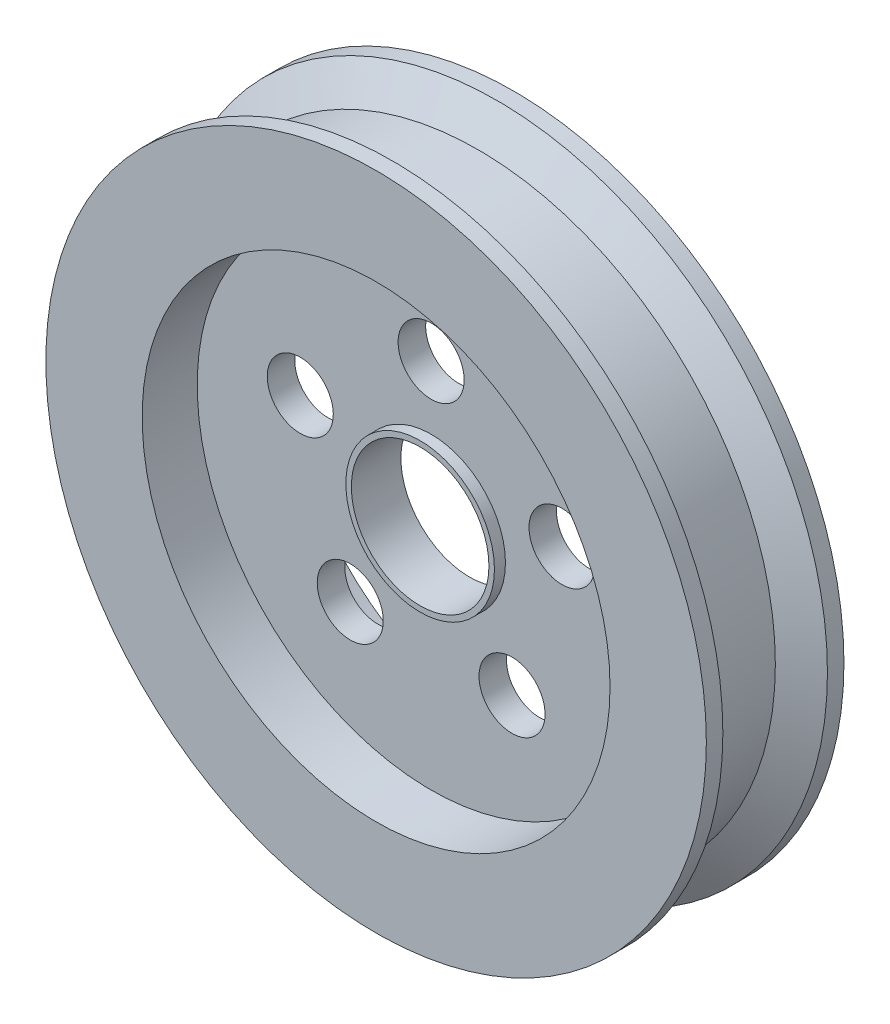
ISO-10303-21;
HEADER;
FILE_DESCRIPTION(('STEP AP214'),'2;1');
FILE_NAME('part.step','',(''),(''),'','','');
FILE_SCHEMA(('AUTOMOTIVE_DESIGN { 1 0 10303 214 1 1 1 1 }'));
ENDSEC;
DATA;
#1=APPLICATION_CONTEXT('core data for automotive mechanical design processes');
#2=APPLICATION_PROTOCOL_DEFINITION('international standard','automotive_design',2000,#1);
#3=PRODUCT_CONTEXT('',#1,'mechanical');
#4=PRODUCT('Part','Part','',(#3));
#5=PRODUCT_RELATED_PRODUCT_CATEGORY('part','',(#4));
#6=PRODUCT_DEFINITION_FORMATION('','',#4);
#7=PRODUCT_DEFINITION_CONTEXT('part definition',#1,'design');
#8=PRODUCT_DEFINITION('design','',#6,#7);
#9=PRODUCT_DEFINITION_SHAPE('','',#8);
#10=(LENGTH_UNIT() NAMED_UNIT(*) SI_UNIT(.MILLI.,.METRE.));
#11=(NAMED_UNIT(*) PLANE_ANGLE_UNIT() SI_UNIT($,.RADIAN.));
#12=(NAMED_UNIT(*) SI_UNIT($,.STERADIAN.) SOLID_ANGLE_UNIT());
#13=UNCERTAINTY_MEASURE_WITH_UNIT(LENGTH_MEASURE(1.E-05),#10,'distance_accuracy_value','');
#14=(GEOMETRIC_REPRESENTATION_CONTEXT(3) GLOBAL_UNCERTAINTY_ASSIGNED_CONTEXT((#13)) GLOBAL_UNIT_ASSIGNED_CONTEXT((#10,
#11,#12)) REPRESENTATION_CONTEXT('',''));
#15=CARTESIAN_POINT('',(0.,0.,0.));
#16=DIRECTION('',(0.,0.,1.));
#17=DIRECTION('',(1.,0.,0.));
#18=AXIS2_PLACEMENT_3D('',#15,#16,#17);
#19=CARTESIAN_POINT('',(0.,0.,12.5));
#20=DIRECTION('',(0.,0.,-1.));
#21=DIRECTION('',(-1.,0.,0.));
#22=AXIS2_PLACEMENT_3D('',#19,#20,#21);
#23=CYLINDRICAL_SURFACE('',#22,60.);
#24=CARTESIAN_POINT('',(0.,0.,-9.5));
#25=DIRECTION('',(0.,0.,1.));
#26=DIRECTION('',(1.,0.,0.));
#27=AXIS2_PLACEMENT_3D('',#24,#25,#26);
#28=CIRCLE('',#27,60.);
#29=CARTESIAN_POINT('',(60.,0.,-9.5));
#30=VERTEX_POINT('',#29);
#31=EDGE_CURVE('E59',#30,#30,#28,.T.);
#32=ORIENTED_EDGE('',*,*,#31,.F.);
#33=EDGE_LOOP('',(#32));
#34=FACE_BOUND('',#33,.T.);
#35=CARTESIAN_POINT('',(0.,0.,-12.5));
#36=DIRECTION('',(0.,0.,1.));
#37=DIRECTION('',(1.,0.,0.));
#38=AXIS2_PLACEMENT_3D('',#35,#36,#37);
#39=CIRCLE('',#38,60.);
#40=CARTESIAN_POINT('',(60.,0.,-12.5));
#41=VERTEX_POINT('',#40);
#42=EDGE_CURVE('E91',#41,#41,#39,.T.);
#43=ORIENTED_EDGE('',*,*,#42,.T.);
#44=EDGE_LOOP('',(#43));
#45=FACE_BOUND('',#44,.T.);
#46=ADVANCED_FACE('F33',(#34,#45),#23,.T.);
#47=CARTESIAN_POINT('',(0.,0.,12.5));
#48=DIRECTION('',(0.,0.,1.));
#49=DIRECTION('',(1.,0.,0.));
#50=AXIS2_PLACEMENT_3D('',#47,#48,#49);
#51=PLANE('',#50);
#52=CARTESIAN_POINT('',(0.,0.,12.5));
#53=DIRECTION('',(0.,0.,1.));
#54=DIRECTION('',(1.,0.,0.));
#55=AXIS2_PLACEMENT_3D('',#52,#53,#54);
#56=CIRCLE('',#55,42.5);
#57=CARTESIAN_POINT('',(42.5,0.,12.5));
#58=VERTEX_POINT('',#57);
#59=EDGE_CURVE('E84',#58,#58,#56,.T.);
#60=ORIENTED_EDGE('',*,*,#59,.F.);
#61=EDGE_LOOP('',(#60));
#62=FACE_BOUND('',#61,.T.);
#63=CARTESIAN_POINT('',(0.,0.,12.5));
#64=DIRECTION('',(0.,0.,1.));
#65=DIRECTION('',(1.,0.,0.));
#66=AXIS2_PLACEMENT_3D('',#63,#64,#65);
#67=CIRCLE('',#66,60.);
#68=CARTESIAN_POINT('',(60.,0.,12.5));
#69=VERTEX_POINT('',#68);
#70=EDGE_CURVE('E45',#69,#69,#67,.T.);
#71=ORIENTED_EDGE('',*,*,#70,.T.);
#72=EDGE_LOOP('',(#71));
#73=FACE_BOUND('',#72,.T.);
#74=ADVANCED_FACE('F138',(#62,#73),#51,.T.);
#75=CARTESIAN_POINT('',(0.,0.,-12.5));
#76=DIRECTION('',(0.,0.,1.));
#77=DIRECTION('',(1.,0.,0.));
#78=AXIS2_PLACEMENT_3D('',#75,#76,#77);
#79=PLANE('',#78);
#80=CARTESIAN_POINT('',(0.,0.,-12.5));
#81=DIRECTION('',(0.,0.,1.));
#82=DIRECTION('',(1.,0.,0.));
#83=AXIS2_PLACEMENT_3D('',#80,#81,#82);
#84=CIRCLE('',#83,42.5);
#85=CARTESIAN_POINT('',(42.5,0.,-12.5));
#86=VERTEX_POINT('',#85);
#87=EDGE_CURVE('E85',#86,#86,#84,.T.);
#88=ORIENTED_EDGE('',*,*,#87,.T.);
#89=EDGE_LOOP('',(#88));
#90=FACE_BOUND('',#89,.T.);
#91=ORIENTED_EDGE('',*,*,#42,.F.);
#92=EDGE_LOOP('',(#91));
#93=FACE_BOUND('',#92,.T.);
#94=ADVANCED_FACE('F135',(#90,#93),#79,.F.);
#95=CARTESIAN_POINT('',(0.,0.,9.5));
#96=DIRECTION('',(0.,0.,1.));
#97=DIRECTION('',(1.,0.,0.));
#98=AXIS2_PLACEMENT_3D('',#95,#96,#97);
#99=CIRCLE('',#98,60.);
#100=CARTESIAN_POINT('',(60.,0.,9.5));
#101=VERTEX_POINT('',#100);
#102=EDGE_CURVE('E56',#101,#101,#99,.T.);
#103=ORIENTED_EDGE('',*,*,#102,.T.);
#104=EDGE_LOOP('',(#103));
#105=FACE_BOUND('',#104,.T.);
#106=ORIENTED_EDGE('',*,*,#70,.F.);
#107=EDGE_LOOP('',(#106));
#108=FACE_BOUND('',#107,.T.);
#109=ADVANCED_FACE('F35',(#105,#108),#23,.T.);
#110=CARTESIAN_POINT('',(0.,0.,2.5));
#111=DIRECTION('',(0.,0.,1.));
#112=DIRECTION('',(1.,0.,0.));
#113=AXIS2_PLACEMENT_3D('',#110,#111,#112);
#114=CYLINDRICAL_SURFACE('',#113,42.5);
#115=CARTESIAN_POINT('',(0.,0.,2.5));
#116=DIRECTION('',(0.,0.,1.));
#117=DIRECTION('',(1.,0.,0.));
#118=AXIS2_PLACEMENT_3D('',#115,#116,#117);
#119=CIRCLE('',#118,42.5);
#120=CARTESIAN_POINT('',(42.5,0.,2.5));
#121=VERTEX_POINT('',#120);
#122=EDGE_CURVE('E88',#121,#121,#119,.T.);
#123=ORIENTED_EDGE('',*,*,#122,.F.);
#124=EDGE_LOOP('',(#123));
#125=FACE_BOUND('',#124,.T.);
#126=ORIENTED_EDGE('',*,*,#59,.T.);
#127=EDGE_LOOP('',(#126));
#128=FACE_BOUND('',#127,.T.);
#129=ADVANCED_FACE('F150',(#125,#128),#114,.F.);
#130=CARTESIAN_POINT('',(0.,0.,2.5));
#131=DIRECTION('',(0.,0.,1.));
#132=DIRECTION('',(1.,0.,0.));
#133=AXIS2_PLACEMENT_3D('',#130,#131,#132);
#134=PLANE('',#133);
#135=CARTESIAN_POINT('',(0.,0.,2.5));
#136=DIRECTION('',(0.,0.,1.));
#137=DIRECTION('',(1.,0.,0.));
#138=AXIS2_PLACEMENT_3D('',#135,#136,#137);
#139=CIRCLE('',#138,13.5);
#140=CARTESIAN_POINT('',(13.5,0.,2.5));
#141=VERTEX_POINT('',#140);
#142=EDGE_CURVE('E10',#141,#141,#139,.T.);
#143=ORIENTED_EDGE('',*,*,#142,.F.);
#144=EDGE_LOOP('',(#143));
#145=FACE_BOUND('',#144,.T.);
#146=CARTESIAN_POINT('',(14.6946313073117,-20.2254248593738,2.5));
#147=DIRECTION('',(0.,0.,1.));
#148=DIRECTION('',(-0.809016994374951,-0.587785252292469,0.));
#149=AXIS2_PLACEMENT_3D('',#146,#147,#148);
#150=CIRCLE('',#149,6.);
#151=CARTESIAN_POINT('',(9.84052934106201,-23.7521363731286,2.5));
#152=VERTEX_POINT('',#151);
#153=EDGE_CURVE('E63',#152,#152,#150,.T.);
#154=ORIENTED_EDGE('',*,*,#153,.F.);
#155=EDGE_LOOP('',(#154));
#156=FACE_BOUND('',#155,.T.);
#157=CARTESIAN_POINT('',(-14.694631307312,-20.2254248593736,2.5));
#158=DIRECTION('',(0.,0.,1.));
#159=DIRECTION('',(-0.809016994374942,0.58778525229248,0.));
#160=AXIS2_PLACEMENT_3D('',#157,#158,#159);
#161=CIRCLE('',#160,6.);
#162=CARTESIAN_POINT('',(-19.5487332735617,-16.6987133456187,2.5));
#163=VERTEX_POINT('',#162);
#164=EDGE_CURVE('E67',#163,#163,#161,.T.);
#165=ORIENTED_EDGE('',*,*,#164,.F.);
#166=EDGE_LOOP('',(#165));
#167=FACE_BOUND('',#166,.T.);
#168=CARTESIAN_POINT('',(-23.7764129073788,7.72542485937396,2.5));
#169=DIRECTION('',(0.,0.,1.));
#170=DIRECTION('',(0.309016994374958,0.95105651629515,0.));
#171=AXIS2_PLACEMENT_3D('',#168,#169,#170);
#172=CIRCLE('',#171,6.);
#173=CARTESIAN_POINT('',(-21.922310941129,13.4317639571449,2.5));
#174=VERTEX_POINT('',#173);
#175=EDGE_CURVE('E62',#174,#174,#172,.T.);
#176=ORIENTED_EDGE('',*,*,#175,.F.);
#177=EDGE_LOOP('',(#176));
#178=FACE_BOUND('',#177,.T.);
#179=CARTESIAN_POINT('',(23.7764129073789,7.72542485937362,2.5));
#180=DIRECTION('',(0.,0.,1.));
#181=DIRECTION('',(0.309016994374945,-0.951056516295155,0.));
#182=AXIS2_PLACEMENT_3D('',#179,#180,#181);
#183=CIRCLE('',#182,6.);
#184=CARTESIAN_POINT('',(25.6305148736285,2.01908576160269,2.5));
#185=VERTEX_POINT('',#184);
#186=EDGE_CURVE('E72',#185,#185,#183,.T.);
#187=ORIENTED_EDGE('',*,*,#186,.F.);
#188=EDGE_LOOP('',(#187));
#189=FACE_BOUND('',#188,.T.);
#190=CARTESIAN_POINT('',(0.,25.,2.5));
#191=DIRECTION('',(0.,0.,1.));
#192=DIRECTION('',(1.,0.,0.));
#193=AXIS2_PLACEMENT_3D('',#190,#191,#192);
#194=CIRCLE('',#193,6.);
#195=CARTESIAN_POINT('',(6.,25.,2.5));
#196=VERTEX_POINT('',#195);
#197=EDGE_CURVE('E77',#196,#196,#194,.T.);
#198=ORIENTED_EDGE('',*,*,#197,.F.);
#199=EDGE_LOOP('',(#198));
#200=FACE_BOUND('',#199,.T.);
#201=ORIENTED_EDGE('',*,*,#122,.T.);
#202=EDGE_LOOP('',(#201));
#203=FACE_BOUND('',#202,.T.);
#204=ADVANCED_FACE('F131',(#145,#156,#167,#178,#189,#200,#203),#134,.T.);
#205=CARTESIAN_POINT('',(0.,0.,-2.5));
#206=DIRECTION('',(0.,0.,-1.));
#207=DIRECTION('',(-1.,0.,0.));
#208=AXIS2_PLACEMENT_3D('',#205,#206,#207);
#209=CYLINDRICAL_SURFACE('',#208,42.5);
#210=CARTESIAN_POINT('',(0.,0.,-2.5));
#211=DIRECTION('',(0.,0.,1.));
#212=DIRECTION('',(1.,0.,0.));
#213=AXIS2_PLACEMENT_3D('',#210,#211,#212);
#214=CIRCLE('',#213,42.5);
#215=CARTESIAN_POINT('',(42.5,0.,-2.5));
#216=VERTEX_POINT('',#215);
#217=EDGE_CURVE('E81',#216,#216,#214,.T.);
#218=ORIENTED_EDGE('',*,*,#217,.T.);
#219=EDGE_LOOP('',(#218));
#220=FACE_BOUND('',#219,.T.);
#221=ORIENTED_EDGE('',*,*,#87,.F.);
#222=EDGE_LOOP('',(#221));
#223=FACE_BOUND('',#222,.T.);
#224=ADVANCED_FACE('F116',(#220,#223),#209,.F.);
#225=CARTESIAN_POINT('',(0.,0.,-2.5));
#226=DIRECTION('',(0.,0.,-1.));
#227=DIRECTION('',(1.,0.,0.));
#228=AXIS2_PLACEMENT_3D('',#225,#226,#227);
#229=PLANE('',#228);
#230=CARTESIAN_POINT('',(0.,0.,-2.5));
#231=DIRECTION('',(0.,0.,-1.));
#232=DIRECTION('',(-1.,0.,0.));
#233=AXIS2_PLACEMENT_3D('',#230,#231,#232);
#234=CIRCLE('',#233,13.5);
#235=CARTESIAN_POINT('',(-13.5,0.,-2.5));
#236=VERTEX_POINT('',#235);
#237=EDGE_CURVE('E37',#236,#236,#234,.T.);
#238=ORIENTED_EDGE('',*,*,#237,.F.);
#239=EDGE_LOOP('',(#238));
#240=FACE_BOUND('',#239,.T.);
#241=CARTESIAN_POINT('',(14.6946313073117,-20.2254248593738,-2.5));
#242=DIRECTION('',(0.,0.,-1.));
#243=DIRECTION('',(-1.,0.,0.));
#244=AXIS2_PLACEMENT_3D('',#241,#242,#243);
#245=CIRCLE('',#244,6.);
#246=CARTESIAN_POINT('',(8.69463130731171,-20.2254248593738,-2.5));
#247=VERTEX_POINT('',#246);
#248=EDGE_CURVE('E76',#247,#247,#245,.T.);
#249=ORIENTED_EDGE('',*,*,#248,.F.);
#250=EDGE_LOOP('',(#249));
#251=FACE_BOUND('',#250,.T.);
#252=CARTESIAN_POINT('',(-14.694631307312,-20.2254248593736,-2.5));
#253=DIRECTION('',(0.,0.,-1.));
#254=DIRECTION('',(-1.,0.,0.));
#255=AXIS2_PLACEMENT_3D('',#252,#253,#254);
#256=CIRCLE('',#255,6.);
#257=CARTESIAN_POINT('',(-20.694631307312,-20.2254248593736,-2.5));
#258=VERTEX_POINT('',#257);
#259=EDGE_CURVE('E104',#258,#258,#256,.T.);
#260=ORIENTED_EDGE('',*,*,#259,.F.);
#261=EDGE_LOOP('',(#260));
#262=FACE_BOUND('',#261,.T.);
#263=CARTESIAN_POINT('',(-23.7764129073788,7.72542485937396,-2.5));
#264=DIRECTION('',(0.,0.,-1.));
#265=DIRECTION('',(-1.,0.,0.));
#266=AXIS2_PLACEMENT_3D('',#263,#264,#265);
#267=CIRCLE('',#266,6.);
#268=CARTESIAN_POINT('',(-29.7764129073788,7.72542485937396,-2.5));
#269=VERTEX_POINT('',#268);
#270=EDGE_CURVE('E66',#269,#269,#267,.T.);
#271=ORIENTED_EDGE('',*,*,#270,.F.);
#272=EDGE_LOOP('',(#271));
#273=FACE_BOUND('',#272,.T.);
#274=CARTESIAN_POINT('',(23.7764129073789,7.72542485937362,-2.5));
#275=DIRECTION('',(0.,0.,-1.));
#276=DIRECTION('',(-1.,0.,0.));
#277=AXIS2_PLACEMENT_3D('',#274,#275,#276);
#278=CIRCLE('',#277,6.);
#279=CARTESIAN_POINT('',(17.7764129073789,7.72542485937362,-2.5));
#280=VERTEX_POINT('',#279);
#281=EDGE_CURVE('E75',#280,#280,#278,.T.);
#282=ORIENTED_EDGE('',*,*,#281,.F.);
#283=EDGE_LOOP('',(#282));
#284=FACE_BOUND('',#283,.T.);
#285=CARTESIAN_POINT('',(0.,25.,-2.5));
#286=DIRECTION('',(0.,0.,-1.));
#287=DIRECTION('',(-1.,0.,0.));
#288=AXIS2_PLACEMENT_3D('',#285,#286,#287);
#289=CIRCLE('',#288,6.);
#290=CARTESIAN_POINT('',(-6.,25.,-2.5));
#291=VERTEX_POINT('',#290);
#292=EDGE_CURVE('E80',#291,#291,#289,.T.);
#293=ORIENTED_EDGE('',*,*,#292,.F.);
#294=EDGE_LOOP('',(#293));
#295=FACE_BOUND('',#294,.T.);
#296=ORIENTED_EDGE('',*,*,#217,.F.);
#297=EDGE_LOOP('',(#296));
#298=FACE_BOUND('',#297,.T.);
#299=ADVANCED_FACE('F112',(#240,#251,#262,#273,#284,#295,#298),#229,.T.);
#300=CARTESIAN_POINT('',(0.,25.,-7.5));
#301=DIRECTION('',(0.,0.,1.));
#302=DIRECTION('',(1.,0.,0.));
#303=AXIS2_PLACEMENT_3D('',#300,#301,#302);
#304=CYLINDRICAL_SURFACE('',#303,6.);
#305=ORIENTED_EDGE('',*,*,#292,.T.);
#306=EDGE_LOOP('',(#305));
#307=FACE_BOUND('',#306,.T.);
#308=ORIENTED_EDGE('',*,*,#197,.T.);
#309=EDGE_LOOP('',(#308));
#310=FACE_BOUND('',#309,.T.);
#311=ADVANCED_FACE('F115',(#307,#310),#304,.F.);
#312=CARTESIAN_POINT('',(23.7764129073789,7.72542485937362,-7.5));
#313=DIRECTION('',(0.,0.,1.));
#314=DIRECTION('',(1.,0.,0.));
#315=AXIS2_PLACEMENT_3D('',#312,#313,#314);
#316=CYLINDRICAL_SURFACE('',#315,6.);
#317=ORIENTED_EDGE('',*,*,#281,.T.);
#318=EDGE_LOOP('',(#317));
#319=FACE_BOUND('',#318,.T.);
#320=ORIENTED_EDGE('',*,*,#186,.T.);
#321=EDGE_LOOP('',(#320));
#322=FACE_BOUND('',#321,.T.);
#323=ADVANCED_FACE('F191',(#319,#322),#316,.F.);
#324=CARTESIAN_POINT('',(-23.7764129073788,7.72542485937396,-7.5));
#325=DIRECTION('',(0.,0.,1.));
#326=DIRECTION('',(1.,0.,0.));
#327=AXIS2_PLACEMENT_3D('',#324,#325,#326);
#328=CYLINDRICAL_SURFACE('',#327,6.);
#329=ORIENTED_EDGE('',*,*,#270,.T.);
#330=EDGE_LOOP('',(#329));
#331=FACE_BOUND('',#330,.T.);
#332=ORIENTED_EDGE('',*,*,#175,.T.);
#333=EDGE_LOOP('',(#332));
#334=FACE_BOUND('',#333,.T.);
#335=ADVANCED_FACE('F187',(#331,#334),#328,.F.);
#336=CARTESIAN_POINT('',(-14.694631307312,-20.2254248593736,-7.5));
#337=DIRECTION('',(0.,0.,1.));
#338=DIRECTION('',(1.,0.,0.));
#339=AXIS2_PLACEMENT_3D('',#336,#337,#338);
#340=CYLINDRICAL_SURFACE('',#339,6.);
#341=ORIENTED_EDGE('',*,*,#259,.T.);
#342=EDGE_LOOP('',(#341));
#343=FACE_BOUND('',#342,.T.);
#344=ORIENTED_EDGE('',*,*,#164,.T.);
#345=EDGE_LOOP('',(#344));
#346=FACE_BOUND('',#345,.T.);
#347=ADVANCED_FACE('F182',(#343,#346),#340,.F.);
#348=CARTESIAN_POINT('',(14.6946313073117,-20.2254248593738,-7.5));
#349=DIRECTION('',(0.,0.,1.));
#350=DIRECTION('',(1.,0.,0.));
#351=AXIS2_PLACEMENT_3D('',#348,#349,#350);
#352=CYLINDRICAL_SURFACE('',#351,6.);
#353=ORIENTED_EDGE('',*,*,#248,.T.);
#354=EDGE_LOOP('',(#353));
#355=FACE_BOUND('',#354,.T.);
#356=ORIENTED_EDGE('',*,*,#153,.T.);
#357=EDGE_LOOP('',(#356));
#358=FACE_BOUND('',#357,.T.);
#359=ADVANCED_FACE('F109',(#355,#358),#352,.F.);
#360=CARTESIAN_POINT('',(0.,0.,-9.5));
#361=DIRECTION('',(0.,0.,-1.));
#362=DIRECTION('',(-1.,0.,0.));
#363=AXIS2_PLACEMENT_3D('',#360,#361,#362);
#364=CONICAL_SURFACE('',#363,60.,1.04719755119659);
#365=CARTESIAN_POINT('',(0.,0.,-6.03589838486221));
#366=DIRECTION('',(0.,0.,1.));
#367=DIRECTION('',(1.,0.,0.));
#368=AXIS2_PLACEMENT_3D('',#365,#366,#367);
#369=CIRCLE('',#368,54.);
#370=CARTESIAN_POINT('',(54.,0.,-6.03589838486221));
#371=VERTEX_POINT('',#370);
#372=EDGE_CURVE('E50',#371,#371,#369,.T.);
#373=ORIENTED_EDGE('',*,*,#372,.F.);
#374=EDGE_LOOP('',(#373));
#375=FACE_BOUND('',#374,.T.);
#376=ORIENTED_EDGE('',*,*,#31,.T.);
#377=EDGE_LOOP('',(#376));
#378=FACE_BOUND('',#377,.T.);
#379=ADVANCED_FACE('F166',(#375,#378),#364,.T.);
#380=CARTESIAN_POINT('',(0.,0.,6.03589838486221));
#381=DIRECTION('',(0.,0.,1.));
#382=DIRECTION('',(1.,0.,0.));
#383=AXIS2_PLACEMENT_3D('',#380,#381,#382);
#384=CONICAL_SURFACE('',#383,54.,1.04719755119659);
#385=ORIENTED_EDGE('',*,*,#102,.F.);
#386=EDGE_LOOP('',(#385));
#387=FACE_BOUND('',#386,.T.);
#388=CARTESIAN_POINT('',(0.,0.,6.03589838486221));
#389=DIRECTION('',(0.,0.,1.));
#390=DIRECTION('',(1.,0.,0.));
#391=AXIS2_PLACEMENT_3D('',#388,#389,#390);
#392=CIRCLE('',#391,54.);
#393=CARTESIAN_POINT('',(54.,0.,6.03589838486221));
#394=VERTEX_POINT('',#393);
#395=EDGE_CURVE('E53',#394,#394,#392,.T.);
#396=ORIENTED_EDGE('',*,*,#395,.T.);
#397=EDGE_LOOP('',(#396));
#398=FACE_BOUND('',#397,.T.);
#399=ADVANCED_FACE('F162',(#387,#398),#384,.T.);
#400=CARTESIAN_POINT('',(0.,0.,0.));
#401=DIRECTION('',(0.,0.,1.));
#402=DIRECTION('',(1.,0.,0.));
#403=AXIS2_PLACEMENT_3D('',#400,#401,#402);
#404=CYLINDRICAL_SURFACE('',#403,54.);
#405=ORIENTED_EDGE('',*,*,#395,.F.);
#406=EDGE_LOOP('',(#405));
#407=FACE_BOUND('',#406,.T.);
#408=ORIENTED_EDGE('',*,*,#372,.T.);
#409=EDGE_LOOP('',(#408));
#410=FACE_BOUND('',#409,.T.);
#411=ADVANCED_FACE('F165',(#407,#410),#404,.T.);
#412=CARTESIAN_POINT('',(0.,0.,-4.5));
#413=DIRECTION('',(0.,0.,1.));
#414=DIRECTION('',(1.,0.,0.));
#415=AXIS2_PLACEMENT_3D('',#412,#413,#414);
#416=CYLINDRICAL_SURFACE('',#415,13.5);
#417=ORIENTED_EDGE('',*,*,#237,.T.);
#418=EDGE_LOOP('',(#417));
#419=FACE_BOUND('',#418,.T.);
#420=CARTESIAN_POINT('',(0.,0.,-4.5));
#421=DIRECTION('',(0.,0.,1.));
#422=DIRECTION('',(1.,0.,0.));
#423=AXIS2_PLACEMENT_3D('',#420,#421,#422);
#424=CIRCLE('',#423,13.5);
#425=CARTESIAN_POINT('',(13.5,0.,-4.5));
#426=VERTEX_POINT('',#425);
#427=EDGE_CURVE('E48',#426,#426,#424,.T.);
#428=ORIENTED_EDGE('',*,*,#427,.T.);
#429=EDGE_LOOP('',(#428));
#430=FACE_BOUND('',#429,.T.);
#431=ADVANCED_FACE('F172',(#419,#430),#416,.T.);
#432=CARTESIAN_POINT('',(0.,0.,-4.5));
#433=DIRECTION('',(0.,0.,1.));
#434=DIRECTION('',(1.,0.,0.));
#435=AXIS2_PLACEMENT_3D('',#432,#433,#434);
#436=PLANE('',#435);
#437=CARTESIAN_POINT('',(0.,0.,-4.5));
#438=DIRECTION('',(0.,0.,1.));
#439=DIRECTION('',(1.,0.,0.));
#440=AXIS2_PLACEMENT_3D('',#437,#438,#439);
#441=CIRCLE('',#440,12.5);
#442=CARTESIAN_POINT('',(12.5,0.,-4.5));
#443=VERTEX_POINT('',#442);
#444=EDGE_CURVE('E215',#443,#443,#441,.T.);
#445=ORIENTED_EDGE('',*,*,#444,.T.);
#446=EDGE_LOOP('',(#445));
#447=FACE_BOUND('',#446,.T.);
#448=ORIENTED_EDGE('',*,*,#427,.F.);
#449=EDGE_LOOP('',(#448));
#450=FACE_BOUND('',#449,.T.);
#451=ADVANCED_FACE('F229',(#447,#450),#436,.F.);
#452=ORIENTED_EDGE('',*,*,#142,.T.);
#453=EDGE_LOOP('',(#452));
#454=FACE_BOUND('',#453,.T.);
#455=CARTESIAN_POINT('',(0.,0.,4.5));
#456=DIRECTION('',(0.,0.,1.));
#457=DIRECTION('',(1.,0.,0.));
#458=AXIS2_PLACEMENT_3D('',#455,#456,#457);
#459=CIRCLE('',#458,13.5);
#460=CARTESIAN_POINT('',(13.5,0.,4.5));
#461=VERTEX_POINT('',#460);
#462=EDGE_CURVE('E220',#461,#461,#459,.T.);
#463=ORIENTED_EDGE('',*,*,#462,.F.);
#464=EDGE_LOOP('',(#463));
#465=FACE_BOUND('',#464,.T.);
#466=ADVANCED_FACE('F209',(#454,#465),#416,.T.);
#467=CARTESIAN_POINT('',(0.,0.,4.5));
#468=DIRECTION('',(0.,0.,1.));
#469=DIRECTION('',(1.,0.,0.));
#470=AXIS2_PLACEMENT_3D('',#467,#468,#469);
#471=PLANE('',#470);
#472=ORIENTED_EDGE('',*,*,#462,.T.);
#473=EDGE_LOOP('',(#472));
#474=FACE_BOUND('',#473,.T.);
#475=CARTESIAN_POINT('',(0.,0.,4.5));
#476=DIRECTION('',(0.,0.,1.));
#477=DIRECTION('',(1.,0.,0.));
#478=AXIS2_PLACEMENT_3D('',#475,#476,#477);
#479=CIRCLE('',#478,12.5);
#480=CARTESIAN_POINT('',(12.5,0.,4.5));
#481=VERTEX_POINT('',#480);
#482=EDGE_CURVE('E218',#481,#481,#479,.T.);
#483=ORIENTED_EDGE('',*,*,#482,.F.);
#484=EDGE_LOOP('',(#483));
#485=FACE_BOUND('',#484,.T.);
#486=ADVANCED_FACE('F204',(#474,#485),#471,.T.);
#487=CARTESIAN_POINT('',(0.,0.,12.5));
#488=DIRECTION('',(0.,0.,-1.));
#489=DIRECTION('',(-1.,0.,0.));
#490=AXIS2_PLACEMENT_3D('',#487,#488,#489);
#491=CYLINDRICAL_SURFACE('',#490,12.5);
#492=ORIENTED_EDGE('',*,*,#444,.F.);
#493=EDGE_LOOP('',(#492));
#494=FACE_BOUND('',#493,.T.);
#495=ORIENTED_EDGE('',*,*,#482,.T.);
#496=EDGE_LOOP('',(#495));
#497=FACE_BOUND('',#496,.T.);
#498=ADVANCED_FACE('F202',(#494,#497),#491,.F.);
#499=CLOSED_SHELL('',(#46,#74,#94,#109,#129,#204,#224,#299,#311,#323,#335,#347,#359,#379,#399,
#411,#431,#451,#466,#486,#498));
#500=MANIFOLD_SOLID_BREP('B2',#499);
#501=ADVANCED_BREP_SHAPE_REPRESENTATION('',(#18,#500),#14);
#502=SHAPE_DEFINITION_REPRESENTATION(#9,#501);
ENDSEC;
END-ISO-10303-21;
